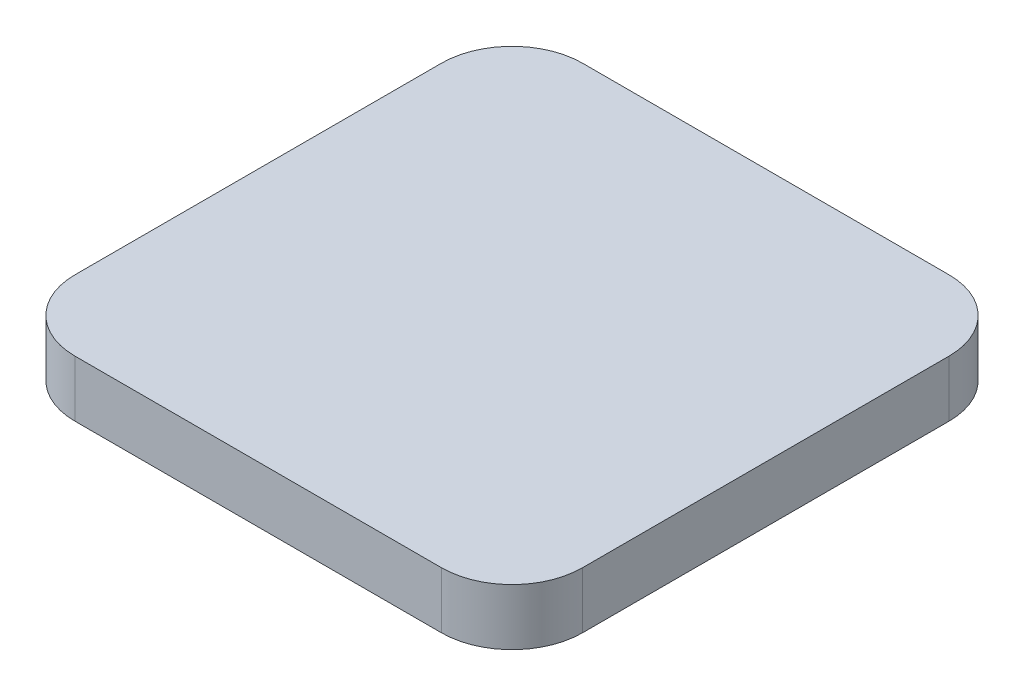
ISO-10303-21;
HEADER;
FILE_DESCRIPTION(('STEP AP214'),'2;1');
FILE_NAME('part.step','',(''),(''),'','','');
FILE_SCHEMA(('AUTOMOTIVE_DESIGN { 1 0 10303 214 1 1 1 1 }'));
ENDSEC;
DATA;
#1=APPLICATION_CONTEXT('core data for automotive mechanical design processes');
#2=APPLICATION_PROTOCOL_DEFINITION('international standard','automotive_design',2000,#1);
#3=PRODUCT_CONTEXT('',#1,'mechanical');
#4=PRODUCT('Part','Part','',(#3));
#5=PRODUCT_RELATED_PRODUCT_CATEGORY('part','',(#4));
#6=PRODUCT_DEFINITION_FORMATION('','',#4);
#7=PRODUCT_DEFINITION_CONTEXT('part definition',#1,'design');
#8=PRODUCT_DEFINITION('design','',#6,#7);
#9=PRODUCT_DEFINITION_SHAPE('','',#8);
#10=(LENGTH_UNIT() NAMED_UNIT(*) SI_UNIT(.MILLI.,.METRE.));
#11=(NAMED_UNIT(*) PLANE_ANGLE_UNIT() SI_UNIT($,.RADIAN.));
#12=(NAMED_UNIT(*) SI_UNIT($,.STERADIAN.) SOLID_ANGLE_UNIT());
#13=UNCERTAINTY_MEASURE_WITH_UNIT(LENGTH_MEASURE(1.E-05),#10,'distance_accuracy_value','');
#14=(GEOMETRIC_REPRESENTATION_CONTEXT(3) GLOBAL_UNCERTAINTY_ASSIGNED_CONTEXT((#13)) GLOBAL_UNIT_ASSIGNED_CONTEXT((#10,
#11,#12)) REPRESENTATION_CONTEXT('',''));
#15=CARTESIAN_POINT('',(0.,0.,0.));
#16=DIRECTION('',(0.,0.,1.));
#17=DIRECTION('',(1.,0.,0.));
#18=AXIS2_PLACEMENT_3D('',#15,#16,#17);
#19=CARTESIAN_POINT('',(0.,4.,0.));
#20=DIRECTION('',(1.,0.,0.));
#21=DIRECTION('',(0.,0.,-1.));
#22=AXIS2_PLACEMENT_3D('',#19,#20,#21);
#23=PLANE('',#22);
#24=DIRECTION('',(0.,0.,1.));
#25=VECTOR('',#24,1.);
#26=CARTESIAN_POINT('',(0.,4.,0.));
#27=LINE('',#26,#25);
#28=CARTESIAN_POINT('',(0.,4.,-31.));
#29=VERTEX_POINT('',#28);
#30=CARTESIAN_POINT('',(0.,4.,-5.));
#31=VERTEX_POINT('',#30);
#32=EDGE_CURVE('E139',#29,#31,#27,.T.);
#33=ORIENTED_EDGE('',*,*,#32,.F.);
#34=DIRECTION('',(0.,-1.,0.));
#35=VECTOR('',#34,1.);
#36=CARTESIAN_POINT('',(0.,4.,-31.));
#37=LINE('',#36,#35);
#38=CARTESIAN_POINT('',(0.,0.,-31.));
#39=VERTEX_POINT('',#38);
#40=EDGE_CURVE('E178',#29,#39,#37,.T.);
#41=ORIENTED_EDGE('',*,*,#40,.T.);
#42=DIRECTION('',(0.,0.,1.));
#43=VECTOR('',#42,1.);
#44=CARTESIAN_POINT('',(0.,0.,0.));
#45=LINE('',#44,#43);
#46=CARTESIAN_POINT('',(0.,0.,-5.));
#47=VERTEX_POINT('',#46);
#48=EDGE_CURVE('E192',#39,#47,#45,.T.);
#49=ORIENTED_EDGE('',*,*,#48,.T.);
#50=DIRECTION('',(0.,-1.,0.));
#51=VECTOR('',#50,1.);
#52=CARTESIAN_POINT('',(0.,4.,-5.));
#53=LINE('',#52,#51);
#54=EDGE_CURVE('E175',#47,#31,#53,.F.);
#55=ORIENTED_EDGE('',*,*,#54,.T.);
#56=EDGE_LOOP('',(#33,#41,#49,#55));
#57=FACE_BOUND('',#56,.T.);
#58=ADVANCED_FACE('F43',(#57),#23,.F.);
#59=CARTESIAN_POINT('',(0.,4.,0.));
#60=DIRECTION('',(0.,0.,-1.));
#61=DIRECTION('',(-1.,0.,0.));
#62=AXIS2_PLACEMENT_3D('',#59,#60,#61);
#63=PLANE('',#62);
#64=DIRECTION('',(1.,0.,0.));
#65=VECTOR('',#64,1.);
#66=CARTESIAN_POINT('',(0.,4.,0.));
#67=LINE('',#66,#65);
#68=CARTESIAN_POINT('',(5.,4.,0.));
#69=VERTEX_POINT('',#68);
#70=CARTESIAN_POINT('',(31.,4.,0.));
#71=VERTEX_POINT('',#70);
#72=EDGE_CURVE('E144',#69,#71,#67,.T.);
#73=ORIENTED_EDGE('',*,*,#72,.F.);
#74=DIRECTION('',(0.,-1.,0.));
#75=VECTOR('',#74,1.);
#76=CARTESIAN_POINT('',(5.,4.,0.));
#77=LINE('',#76,#75);
#78=CARTESIAN_POINT('',(5.,0.,0.));
#79=VERTEX_POINT('',#78);
#80=EDGE_CURVE('E11',#69,#79,#77,.T.);
#81=ORIENTED_EDGE('',*,*,#80,.T.);
#82=DIRECTION('',(1.,0.,0.));
#83=VECTOR('',#82,1.);
#84=CARTESIAN_POINT('',(0.,0.,0.));
#85=LINE('',#84,#83);
#86=CARTESIAN_POINT('',(31.,0.,0.));
#87=VERTEX_POINT('',#86);
#88=EDGE_CURVE('E146',#79,#87,#85,.T.);
#89=ORIENTED_EDGE('',*,*,#88,.T.);
#90=DIRECTION('',(0.,-1.,0.));
#91=VECTOR('',#90,1.);
#92=CARTESIAN_POINT('',(31.,4.,0.));
#93=LINE('',#92,#91);
#94=EDGE_CURVE('E52',#87,#71,#93,.F.);
#95=ORIENTED_EDGE('',*,*,#94,.T.);
#96=EDGE_LOOP('',(#73,#81,#89,#95));
#97=FACE_BOUND('',#96,.T.);
#98=ADVANCED_FACE('F197',(#97),#63,.F.);
#99=CARTESIAN_POINT('',(36.,4.,0.));
#100=DIRECTION('',(-1.,0.,0.));
#101=DIRECTION('',(0.,0.,1.));
#102=AXIS2_PLACEMENT_3D('',#99,#100,#101);
#103=PLANE('',#102);
#104=DIRECTION('',(0.,0.,-1.));
#105=VECTOR('',#104,1.);
#106=CARTESIAN_POINT('',(36.,0.,0.));
#107=LINE('',#106,#105);
#108=CARTESIAN_POINT('',(36.,0.,-5.));
#109=VERTEX_POINT('',#108);
#110=CARTESIAN_POINT('',(36.,0.,-31.));
#111=VERTEX_POINT('',#110);
#112=EDGE_CURVE('E140',#109,#111,#107,.T.);
#113=ORIENTED_EDGE('',*,*,#112,.T.);
#114=DIRECTION('',(0.,-1.,0.));
#115=VECTOR('',#114,1.);
#116=CARTESIAN_POINT('',(36.,4.,-31.));
#117=LINE('',#116,#115);
#118=CARTESIAN_POINT('',(36.,4.,-31.));
#119=VERTEX_POINT('',#118);
#120=EDGE_CURVE('E115',#111,#119,#117,.F.);
#121=ORIENTED_EDGE('',*,*,#120,.T.);
#122=DIRECTION('',(0.,0.,-1.));
#123=VECTOR('',#122,1.);
#124=CARTESIAN_POINT('',(36.,4.,0.));
#125=LINE('',#124,#123);
#126=CARTESIAN_POINT('',(36.,4.,-5.));
#127=VERTEX_POINT('',#126);
#128=EDGE_CURVE('E184',#127,#119,#125,.T.);
#129=ORIENTED_EDGE('',*,*,#128,.F.);
#130=DIRECTION('',(0.,-1.,0.));
#131=VECTOR('',#130,1.);
#132=CARTESIAN_POINT('',(36.,4.,-5.));
#133=LINE('',#132,#131);
#134=EDGE_CURVE('E121',#127,#109,#133,.T.);
#135=ORIENTED_EDGE('',*,*,#134,.T.);
#136=EDGE_LOOP('',(#113,#121,#129,#135));
#137=FACE_BOUND('',#136,.T.);
#138=ADVANCED_FACE('F204',(#137),#103,.F.);
#139=CARTESIAN_POINT('',(0.,4.,-36.));
#140=DIRECTION('',(0.,0.,1.));
#141=DIRECTION('',(1.,0.,0.));
#142=AXIS2_PLACEMENT_3D('',#139,#140,#141);
#143=PLANE('',#142);
#144=DIRECTION('',(-1.,0.,0.));
#145=VECTOR('',#144,1.);
#146=CARTESIAN_POINT('',(0.,4.,-36.));
#147=LINE('',#146,#145);
#148=CARTESIAN_POINT('',(31.,4.,-36.));
#149=VERTEX_POINT('',#148);
#150=CARTESIAN_POINT('',(5.,4.,-36.));
#151=VERTEX_POINT('',#150);
#152=EDGE_CURVE('E131',#149,#151,#147,.T.);
#153=ORIENTED_EDGE('',*,*,#152,.F.);
#154=DIRECTION('',(0.,-1.,0.));
#155=VECTOR('',#154,1.);
#156=CARTESIAN_POINT('',(31.,4.,-36.));
#157=LINE('',#156,#155);
#158=CARTESIAN_POINT('',(31.,0.,-36.));
#159=VERTEX_POINT('',#158);
#160=EDGE_CURVE('E114',#149,#159,#157,.T.);
#161=ORIENTED_EDGE('',*,*,#160,.T.);
#162=DIRECTION('',(-1.,0.,0.));
#163=VECTOR('',#162,1.);
#164=CARTESIAN_POINT('',(0.,0.,-36.));
#165=LINE('',#164,#163);
#166=CARTESIAN_POINT('',(5.,0.,-36.));
#167=VERTEX_POINT('',#166);
#168=EDGE_CURVE('E128',#159,#167,#165,.T.);
#169=ORIENTED_EDGE('',*,*,#168,.T.);
#170=DIRECTION('',(0.,-1.,0.));
#171=VECTOR('',#170,1.);
#172=CARTESIAN_POINT('',(5.,4.,-36.));
#173=LINE('',#172,#171);
#174=EDGE_CURVE('E134',#167,#151,#173,.F.);
#175=ORIENTED_EDGE('',*,*,#174,.T.);
#176=EDGE_LOOP('',(#153,#161,#169,#175));
#177=FACE_BOUND('',#176,.T.);
#178=ADVANCED_FACE('F127',(#177),#143,.F.);
#179=CARTESIAN_POINT('',(0.,4.,0.));
#180=DIRECTION('',(0.,-1.,0.));
#181=DIRECTION('',(0.,0.,-1.));
#182=AXIS2_PLACEMENT_3D('',#179,#180,#181);
#183=PLANE('',#182);
#184=ORIENTED_EDGE('',*,*,#128,.T.);
#185=CARTESIAN_POINT('',(31.,4.,-31.));
#186=DIRECTION('',(0.,-1.,0.));
#187=DIRECTION('',(0.,0.,-1.));
#188=AXIS2_PLACEMENT_3D('',#185,#186,#187);
#189=CIRCLE('',#188,5.);
#190=EDGE_CURVE('E172',#119,#149,#189,.F.);
#191=ORIENTED_EDGE('',*,*,#190,.T.);
#192=ORIENTED_EDGE('',*,*,#152,.T.);
#193=CARTESIAN_POINT('',(5.,4.,-31.));
#194=DIRECTION('',(0.,-1.,0.));
#195=DIRECTION('',(0.,0.,-1.));
#196=AXIS2_PLACEMENT_3D('',#193,#194,#195);
#197=CIRCLE('',#196,5.);
#198=EDGE_CURVE('E169',#151,#29,#197,.F.);
#199=ORIENTED_EDGE('',*,*,#198,.T.);
#200=ORIENTED_EDGE('',*,*,#32,.T.);
#201=CARTESIAN_POINT('',(5.,4.,-5.));
#202=DIRECTION('',(0.,-1.,0.));
#203=DIRECTION('',(0.,0.,-1.));
#204=AXIS2_PLACEMENT_3D('',#201,#202,#203);
#205=CIRCLE('',#204,5.);
#206=EDGE_CURVE('E65',#31,#69,#205,.F.);
#207=ORIENTED_EDGE('',*,*,#206,.T.);
#208=ORIENTED_EDGE('',*,*,#72,.T.);
#209=CARTESIAN_POINT('',(31.,4.,-5.));
#210=DIRECTION('',(0.,-1.,0.));
#211=DIRECTION('',(0.,0.,-1.));
#212=AXIS2_PLACEMENT_3D('',#209,#210,#211);
#213=CIRCLE('',#212,5.);
#214=EDGE_CURVE('E164',#71,#127,#213,.F.);
#215=ORIENTED_EDGE('',*,*,#214,.T.);
#216=EDGE_LOOP('',(#184,#191,#192,#199,#200,#207,#208,#215));
#217=FACE_BOUND('',#216,.T.);
#218=ADVANCED_FACE('F202',(#217),#183,.F.);
#219=CARTESIAN_POINT('',(0.,0.,0.));
#220=DIRECTION('',(0.,-1.,0.));
#221=DIRECTION('',(0.,0.,-1.));
#222=AXIS2_PLACEMENT_3D('',#219,#220,#221);
#223=PLANE('',#222);
#224=ORIENTED_EDGE('',*,*,#168,.F.);
#225=CARTESIAN_POINT('',(31.,0.,-31.));
#226=DIRECTION('',(0.,-1.,0.));
#227=DIRECTION('',(0.,0.,-1.));
#228=AXIS2_PLACEMENT_3D('',#225,#226,#227);
#229=CIRCLE('',#228,5.);
#230=EDGE_CURVE('E110',#159,#111,#229,.T.);
#231=ORIENTED_EDGE('',*,*,#230,.T.);
#232=ORIENTED_EDGE('',*,*,#112,.F.);
#233=CARTESIAN_POINT('',(31.,0.,-5.));
#234=DIRECTION('',(0.,-1.,0.));
#235=DIRECTION('',(0.,0.,-1.));
#236=AXIS2_PLACEMENT_3D('',#233,#234,#235);
#237=CIRCLE('',#236,5.);
#238=EDGE_CURVE('E133',#109,#87,#237,.T.);
#239=ORIENTED_EDGE('',*,*,#238,.T.);
#240=ORIENTED_EDGE('',*,*,#88,.F.);
#241=CARTESIAN_POINT('',(5.,0.,-5.));
#242=DIRECTION('',(0.,-1.,0.));
#243=DIRECTION('',(0.,0.,-1.));
#244=AXIS2_PLACEMENT_3D('',#241,#242,#243);
#245=CIRCLE('',#244,5.);
#246=EDGE_CURVE('E154',#79,#47,#245,.T.);
#247=ORIENTED_EDGE('',*,*,#246,.T.);
#248=ORIENTED_EDGE('',*,*,#48,.F.);
#249=CARTESIAN_POINT('',(5.,0.,-31.));
#250=DIRECTION('',(0.,-1.,0.));
#251=DIRECTION('',(0.,0.,-1.));
#252=AXIS2_PLACEMENT_3D('',#249,#250,#251);
#253=CIRCLE('',#252,5.);
#254=EDGE_CURVE('E122',#39,#167,#253,.T.);
#255=ORIENTED_EDGE('',*,*,#254,.T.);
#256=EDGE_LOOP('',(#224,#231,#232,#239,#240,#247,#248,#255));
#257=FACE_BOUND('',#256,.T.);
#258=ADVANCED_FACE('F136',(#257),#223,.T.);
#259=CARTESIAN_POINT('',(31.,4.,-31.));
#260=DIRECTION('',(0.,-1.,0.));
#261=DIRECTION('',(0.,0.,-1.));
#262=AXIS2_PLACEMENT_3D('',#259,#260,#261);
#263=CYLINDRICAL_SURFACE('',#262,5.);
#264=ORIENTED_EDGE('',*,*,#190,.F.);
#265=ORIENTED_EDGE('',*,*,#120,.F.);
#266=ORIENTED_EDGE('',*,*,#230,.F.);
#267=ORIENTED_EDGE('',*,*,#160,.F.);
#268=EDGE_LOOP('',(#264,#265,#266,#267));
#269=FACE_BOUND('',#268,.T.);
#270=ADVANCED_FACE('F113',(#269),#263,.T.);
#271=CARTESIAN_POINT('',(5.,4.,-31.));
#272=DIRECTION('',(0.,-1.,0.));
#273=DIRECTION('',(0.,0.,-1.));
#274=AXIS2_PLACEMENT_3D('',#271,#272,#273);
#275=CYLINDRICAL_SURFACE('',#274,5.);
#276=ORIENTED_EDGE('',*,*,#198,.F.);
#277=ORIENTED_EDGE('',*,*,#174,.F.);
#278=ORIENTED_EDGE('',*,*,#254,.F.);
#279=ORIENTED_EDGE('',*,*,#40,.F.);
#280=EDGE_LOOP('',(#276,#277,#278,#279));
#281=FACE_BOUND('',#280,.T.);
#282=ADVANCED_FACE('F222',(#281),#275,.T.);
#283=CARTESIAN_POINT('',(5.,4.,-5.));
#284=DIRECTION('',(0.,-1.,0.));
#285=DIRECTION('',(0.,0.,-1.));
#286=AXIS2_PLACEMENT_3D('',#283,#284,#285);
#287=CYLINDRICAL_SURFACE('',#286,5.);
#288=ORIENTED_EDGE('',*,*,#206,.F.);
#289=ORIENTED_EDGE('',*,*,#54,.F.);
#290=ORIENTED_EDGE('',*,*,#246,.F.);
#291=ORIENTED_EDGE('',*,*,#80,.F.);
#292=EDGE_LOOP('',(#288,#289,#290,#291));
#293=FACE_BOUND('',#292,.T.);
#294=ADVANCED_FACE('F224',(#293),#287,.T.);
#295=CARTESIAN_POINT('',(31.,4.,-5.));
#296=DIRECTION('',(0.,-1.,0.));
#297=DIRECTION('',(0.,0.,-1.));
#298=AXIS2_PLACEMENT_3D('',#295,#296,#297);
#299=CYLINDRICAL_SURFACE('',#298,5.);
#300=ORIENTED_EDGE('',*,*,#214,.F.);
#301=ORIENTED_EDGE('',*,*,#94,.F.);
#302=ORIENTED_EDGE('',*,*,#238,.F.);
#303=ORIENTED_EDGE('',*,*,#134,.F.);
#304=EDGE_LOOP('',(#300,#301,#302,#303));
#305=FACE_BOUND('',#304,.T.);
#306=ADVANCED_FACE('F45',(#305),#299,.T.);
#307=CLOSED_SHELL('',(#58,#98,#138,#178,#218,#258,#270,#282,#294,#306));
#308=MANIFOLD_SOLID_BREP('B2',#307);
#309=ADVANCED_BREP_SHAPE_REPRESENTATION('',(#18,#308),#14);
#310=SHAPE_DEFINITION_REPRESENTATION(#9,#309);
ENDSEC;
END-ISO-10303-21;
